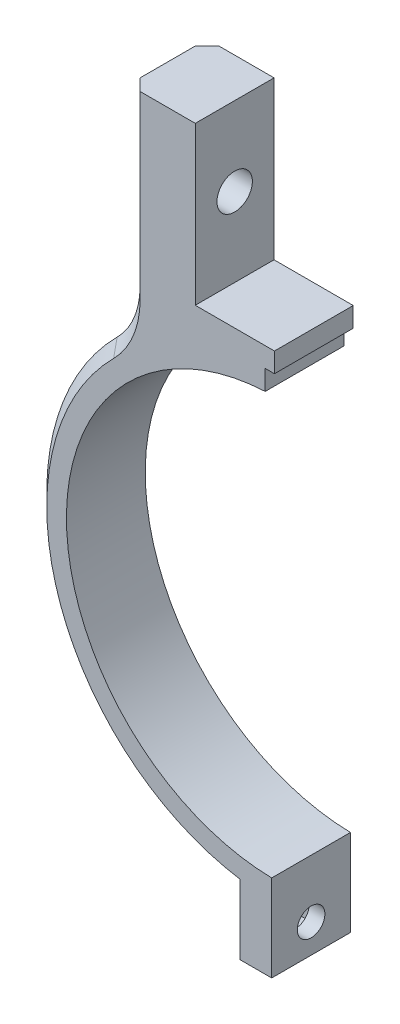
ISO-10303-21;
HEADER;
FILE_DESCRIPTION(('STEP AP214'),'2;1');
FILE_NAME('part.step','',(''),(''),'','','');
FILE_SCHEMA(('AUTOMOTIVE_DESIGN { 1 0 10303 214 1 1 1 1 }'));
ENDSEC;
DATA;
#1=APPLICATION_CONTEXT('core data for automotive mechanical design processes');
#2=APPLICATION_PROTOCOL_DEFINITION('international standard','automotive_design',2000,#1);
#3=PRODUCT_CONTEXT('',#1,'mechanical');
#4=PRODUCT('Part','Part','',(#3));
#5=PRODUCT_RELATED_PRODUCT_CATEGORY('part','',(#4));
#6=PRODUCT_DEFINITION_FORMATION('','',#4);
#7=PRODUCT_DEFINITION_CONTEXT('part definition',#1,'design');
#8=PRODUCT_DEFINITION('design','',#6,#7);
#9=PRODUCT_DEFINITION_SHAPE('','',#8);
#10=(LENGTH_UNIT() NAMED_UNIT(*) SI_UNIT(.MILLI.,.METRE.));
#11=(NAMED_UNIT(*) PLANE_ANGLE_UNIT() SI_UNIT($,.RADIAN.));
#12=(NAMED_UNIT(*) SI_UNIT($,.STERADIAN.) SOLID_ANGLE_UNIT());
#13=UNCERTAINTY_MEASURE_WITH_UNIT(LENGTH_MEASURE(1.E-05),#10,'distance_accuracy_value','');
#14=(GEOMETRIC_REPRESENTATION_CONTEXT(3) GLOBAL_UNCERTAINTY_ASSIGNED_CONTEXT((#13)) GLOBAL_UNIT_ASSIGNED_CONTEXT((#10,
#11,#12)) REPRESENTATION_CONTEXT('',''));
#15=CARTESIAN_POINT('',(0.,0.,0.));
#16=DIRECTION('',(0.,0.,1.));
#17=DIRECTION('',(1.,0.,0.));
#18=AXIS2_PLACEMENT_3D('',#15,#16,#17);
#19=CARTESIAN_POINT('',(-10.2,31.55,10.));
#20=DIRECTION('',(0.,-1.,0.));
#21=DIRECTION('',(0.,0.,-1.));
#22=AXIS2_PLACEMENT_3D('',#19,#20,#21);
#23=PLANE('',#22);
#24=DIRECTION('',(-1.,0.,0.));
#25=VECTOR('',#24,1.);
#26=CARTESIAN_POINT('',(-10.2,31.55,10.));
#27=LINE('',#26,#25);
#28=CARTESIAN_POINT('',(-0.15,31.55,10.));
#29=VERTEX_POINT('',#28);
#30=CARTESIAN_POINT('',(-10.2,31.55,10.));
#31=VERTEX_POINT('',#30);
#32=EDGE_CURVE('E263',#29,#31,#27,.T.);
#33=ORIENTED_EDGE('',*,*,#32,.F.);
#34=DIRECTION('',(0.,0.,1.));
#35=VECTOR('',#34,1.);
#36=CARTESIAN_POINT('',(-0.15,31.55,0.));
#37=LINE('',#36,#35);
#38=CARTESIAN_POINT('',(-0.15,31.55,0.));
#39=VERTEX_POINT('',#38);
#40=EDGE_CURVE('E195',#39,#29,#37,.T.);
#41=ORIENTED_EDGE('',*,*,#40,.F.);
#42=DIRECTION('',(-1.,0.,0.));
#43=VECTOR('',#42,1.);
#44=CARTESIAN_POINT('',(-10.2,31.55,0.));
#45=LINE('',#44,#43);
#46=CARTESIAN_POINT('',(-10.2,31.55,0.));
#47=VERTEX_POINT('',#46);
#48=EDGE_CURVE('E262',#39,#47,#45,.T.);
#49=ORIENTED_EDGE('',*,*,#48,.T.);
#50=DIRECTION('',(0.,0.,-1.));
#51=VECTOR('',#50,1.);
#52=CARTESIAN_POINT('',(-10.2,31.55,10.));
#53=LINE('',#52,#51);
#54=EDGE_CURVE('E312',#31,#47,#53,.T.);
#55=ORIENTED_EDGE('',*,*,#54,.F.);
#56=EDGE_LOOP('',(#33,#41,#49,#55));
#57=FACE_BOUND('',#56,.T.);
#58=ADVANCED_FACE('F38',(#57),#23,.F.);
#59=CARTESIAN_POINT('',(0.,0.,10.));
#60=DIRECTION('',(0.,0.,-1.));
#61=DIRECTION('',(-1.,0.,0.));
#62=AXIS2_PLACEMENT_3D('',#59,#60,#61);
#63=CYLINDRICAL_SURFACE('',#62,26.55);
#64=CARTESIAN_POINT('',(0.,0.,0.));
#65=DIRECTION('',(0.,0.,-1.));
#66=DIRECTION('',(1.,0.,0.));
#67=AXIS2_PLACEMENT_3D('',#64,#65,#66);
#68=CIRCLE('',#67,26.55);
#69=CARTESIAN_POINT('',(-0.50000000000001,-26.5452914845552,0.));
#70=VERTEX_POINT('',#69);
#71=CARTESIAN_POINT('',(-1.325,26.5169167702431,0.));
#72=VERTEX_POINT('',#71);
#73=EDGE_CURVE('E266',#70,#72,#68,.T.);
#74=ORIENTED_EDGE('',*,*,#73,.T.);
#75=DIRECTION('',(0.,0.,-1.));
#76=VECTOR('',#75,1.);
#77=CARTESIAN_POINT('',(-1.325,26.5169167702431,10.));
#78=LINE('',#77,#76);
#79=CARTESIAN_POINT('',(-1.325,26.5169167702431,10.));
#80=VERTEX_POINT('',#79);
#81=EDGE_CURVE('E57',#72,#80,#78,.F.);
#82=ORIENTED_EDGE('',*,*,#81,.T.);
#83=CARTESIAN_POINT('',(0.,0.,10.));
#84=DIRECTION('',(0.,0.,-1.));
#85=DIRECTION('',(1.,0.,0.));
#86=AXIS2_PLACEMENT_3D('',#83,#84,#85);
#87=CIRCLE('',#86,26.55);
#88=CARTESIAN_POINT('',(-0.50000000000001,-26.5452914845552,10.));
#89=VERTEX_POINT('',#88);
#90=EDGE_CURVE('E277',#89,#80,#87,.T.);
#91=ORIENTED_EDGE('',*,*,#90,.F.);
#92=DIRECTION('',(0.,0.,-1.));
#93=VECTOR('',#92,1.);
#94=CARTESIAN_POINT('',(-0.50000000000001,-26.5452914845552,10.));
#95=LINE('',#94,#93);
#96=EDGE_CURVE('E280',#89,#70,#95,.T.);
#97=ORIENTED_EDGE('',*,*,#96,.T.);
#98=EDGE_LOOP('',(#74,#82,#91,#97));
#99=FACE_BOUND('',#98,.T.);
#100=ADVANCED_FACE('F405',(#99),#63,.F.);
#101=CARTESIAN_POINT('',(0.,0.,10.));
#102=DIRECTION('',(0.,0.,1.));
#103=DIRECTION('',(1.,0.,0.));
#104=AXIS2_PLACEMENT_3D('',#101,#102,#103);
#105=PLANE('',#104);
#106=DIRECTION('',(0.,-1.,0.));
#107=VECTOR('',#106,1.);
#108=CARTESIAN_POINT('',(-0.15,29.05,10.));
#109=LINE('',#108,#107);
#110=CARTESIAN_POINT('',(-0.15,29.05,10.));
#111=VERTEX_POINT('',#110);
#112=EDGE_CURVE('E206',#29,#111,#109,.T.);
#113=ORIENTED_EDGE('',*,*,#112,.F.);
#114=ORIENTED_EDGE('',*,*,#32,.T.);
#115=DIRECTION('',(0.,1.,0.));
#116=VECTOR('',#115,1.);
#117=CARTESIAN_POINT('',(-10.2,31.55,10.));
#118=LINE('',#117,#116);
#119=CARTESIAN_POINT('',(-10.2,51.55,10.));
#120=VERTEX_POINT('',#119);
#121=EDGE_CURVE('E265',#31,#120,#118,.T.);
#122=ORIENTED_EDGE('',*,*,#121,.T.);
#123=DIRECTION('',(-1.,0.,0.));
#124=VECTOR('',#123,1.);
#125=CARTESIAN_POINT('',(-10.2,51.55,10.));
#126=LINE('',#125,#124);
#127=CARTESIAN_POINT('',(-17.2,51.55,10.));
#128=VERTEX_POINT('',#127);
#129=EDGE_CURVE('E268',#120,#128,#126,.T.);
#130=ORIENTED_EDGE('',*,*,#129,.T.);
#131=DIRECTION('',(0.,-1.,0.));
#132=VECTOR('',#131,1.);
#133=CARTESIAN_POINT('',(-17.2,28.6463348440948,10.));
#134=LINE('',#133,#132);
#135=CARTESIAN_POINT('',(-17.2,28.6463348440948,10.));
#136=VERTEX_POINT('',#135);
#137=EDGE_CURVE('E355',#128,#136,#134,.T.);
#138=ORIENTED_EDGE('',*,*,#137,.T.);
#139=CARTESIAN_POINT('',(-28.7,28.6463348440948,10.));
#140=DIRECTION('',(0.,0.,1.));
#141=DIRECTION('',(1.,0.,0.));
#142=AXIS2_PLACEMENT_3D('',#139,#140,#141);
#143=CIRCLE('',#142,11.5);
#144=CARTESIAN_POINT('',(-20.5606658446363,20.5222201534144,10.));
#145=VERTEX_POINT('',#144);
#146=EDGE_CURVE('E353',#136,#145,#143,.F.);
#147=ORIENTED_EDGE('',*,*,#146,.T.);
#148=CARTESIAN_POINT('',(0.,0.,10.));
#149=DIRECTION('',(0.,0.,1.));
#150=DIRECTION('',(1.,0.,0.));
#151=AXIS2_PLACEMENT_3D('',#148,#149,#150);
#152=CIRCLE('',#151,29.05);
#153=CARTESIAN_POINT('',(-4.5,-28.6993466824595,10.));
#154=VERTEX_POINT('',#153);
#155=EDGE_CURVE('E349',#145,#154,#152,.T.);
#156=ORIENTED_EDGE('',*,*,#155,.T.);
#157=DIRECTION('',(0.,-1.,0.));
#158=VECTOR('',#157,1.);
#159=CARTESIAN_POINT('',(-4.5,-37.5459080729318,10.));
#160=LINE('',#159,#158);
#161=CARTESIAN_POINT('',(-4.5,-37.5459080729318,10.));
#162=VERTEX_POINT('',#161);
#163=EDGE_CURVE('E271',#154,#162,#160,.T.);
#164=ORIENTED_EDGE('',*,*,#163,.T.);
#165=DIRECTION('',(1.,0.,0.));
#166=VECTOR('',#165,1.);
#167=CARTESIAN_POINT('',(-0.499999999999996,-37.5459080729318,10.));
#168=LINE('',#167,#166);
#169=CARTESIAN_POINT('',(-0.499999999999996,-37.5459080729318,10.));
#170=VERTEX_POINT('',#169);
#171=EDGE_CURVE('E273',#162,#170,#168,.T.);
#172=ORIENTED_EDGE('',*,*,#171,.T.);
#173=DIRECTION('',(0.,1.,0.));
#174=VECTOR('',#173,1.);
#175=CARTESIAN_POINT('',(-0.499999999999996,-30.5459080729318,10.));
#176=LINE('',#175,#174);
#177=EDGE_CURVE('E275',#170,#89,#176,.T.);
#178=ORIENTED_EDGE('',*,*,#177,.T.);
#179=ORIENTED_EDGE('',*,*,#90,.T.);
#180=DIRECTION('',(0.,-1.,0.));
#181=VECTOR('',#180,1.);
#182=CARTESIAN_POINT('',(-1.325,29.05,10.));
#183=LINE('',#182,#181);
#184=CARTESIAN_POINT('',(-1.325,29.05,10.));
#185=VERTEX_POINT('',#184);
#186=EDGE_CURVE('E209',#185,#80,#183,.T.);
#187=ORIENTED_EDGE('',*,*,#186,.F.);
#188=DIRECTION('',(-1.,0.,0.));
#189=VECTOR('',#188,1.);
#190=CARTESIAN_POINT('',(-0.15,29.05,10.));
#191=LINE('',#190,#189);
#192=EDGE_CURVE('E193',#111,#185,#191,.T.);
#193=ORIENTED_EDGE('',*,*,#192,.F.);
#194=EDGE_LOOP('',(#113,#114,#122,#130,#138,#147,#156,#164,#172,#178,#179,#187,#193));
#195=FACE_BOUND('',#194,.T.);
#196=ADVANCED_FACE('F411',(#195),#105,.T.);
#197=CARTESIAN_POINT('',(0.,0.,0.));
#198=DIRECTION('',(0.,0.,1.));
#199=DIRECTION('',(1.,0.,0.));
#200=AXIS2_PLACEMENT_3D('',#197,#198,#199);
#201=PLANE('',#200);
#202=ORIENTED_EDGE('',*,*,#48,.F.);
#203=DIRECTION('',(0.,-1.,0.));
#204=VECTOR('',#203,1.);
#205=CARTESIAN_POINT('',(-0.15,29.05,0.));
#206=LINE('',#205,#204);
#207=CARTESIAN_POINT('',(-0.15,29.05,0.));
#208=VERTEX_POINT('',#207);
#209=EDGE_CURVE('E196',#39,#208,#206,.T.);
#210=ORIENTED_EDGE('',*,*,#209,.T.);
#211=DIRECTION('',(-1.,0.,0.));
#212=VECTOR('',#211,1.);
#213=CARTESIAN_POINT('',(-0.15,29.05,0.));
#214=LINE('',#213,#212);
#215=CARTESIAN_POINT('',(-1.325,29.05,0.));
#216=VERTEX_POINT('',#215);
#217=EDGE_CURVE('E190',#208,#216,#214,.T.);
#218=ORIENTED_EDGE('',*,*,#217,.T.);
#219=DIRECTION('',(0.,-1.,0.));
#220=VECTOR('',#219,1.);
#221=CARTESIAN_POINT('',(-1.325,29.05,0.));
#222=LINE('',#221,#220);
#223=EDGE_CURVE('E198',#216,#72,#222,.T.);
#224=ORIENTED_EDGE('',*,*,#223,.T.);
#225=ORIENTED_EDGE('',*,*,#73,.F.);
#226=DIRECTION('',(0.,1.,0.));
#227=VECTOR('',#226,1.);
#228=CARTESIAN_POINT('',(-0.499999999999997,-26.5452914845552,0.));
#229=LINE('',#228,#227);
#230=CARTESIAN_POINT('',(-0.499999999999996,-37.5459080729318,0.));
#231=VERTEX_POINT('',#230);
#232=EDGE_CURVE('E292',#231,#70,#229,.T.);
#233=ORIENTED_EDGE('',*,*,#232,.F.);
#234=DIRECTION('',(1.,0.,0.));
#235=VECTOR('',#234,1.);
#236=CARTESIAN_POINT('',(-0.499999999999996,-37.5459080729318,0.));
#237=LINE('',#236,#235);
#238=CARTESIAN_POINT('',(-4.5,-37.5459080729318,0.));
#239=VERTEX_POINT('',#238);
#240=EDGE_CURVE('E289',#239,#231,#237,.T.);
#241=ORIENTED_EDGE('',*,*,#240,.F.);
#242=DIRECTION('',(0.,-1.,0.));
#243=VECTOR('',#242,1.);
#244=CARTESIAN_POINT('',(-4.5,-37.5459080729318,0.));
#245=LINE('',#244,#243);
#246=CARTESIAN_POINT('',(-4.5,-28.6993466824595,0.));
#247=VERTEX_POINT('',#246);
#248=EDGE_CURVE('E287',#247,#239,#245,.T.);
#249=ORIENTED_EDGE('',*,*,#248,.F.);
#250=CARTESIAN_POINT('',(0.,0.,0.));
#251=DIRECTION('',(0.,0.,1.));
#252=DIRECTION('',(1.,0.,0.));
#253=AXIS2_PLACEMENT_3D('',#250,#251,#252);
#254=CIRCLE('',#253,29.05);
#255=CARTESIAN_POINT('',(-20.5606658446363,20.5222201534144,0.));
#256=VERTEX_POINT('',#255);
#257=EDGE_CURVE('E328',#247,#256,#254,.F.);
#258=ORIENTED_EDGE('',*,*,#257,.T.);
#259=CARTESIAN_POINT('',(-28.7,28.6463348440948,0.));
#260=DIRECTION('',(0.,0.,1.));
#261=DIRECTION('',(1.,0.,0.));
#262=AXIS2_PLACEMENT_3D('',#259,#260,#261);
#263=CIRCLE('',#262,11.5);
#264=CARTESIAN_POINT('',(-17.2,28.6463348440948,0.));
#265=VERTEX_POINT('',#264);
#266=EDGE_CURVE('E331',#256,#265,#263,.T.);
#267=ORIENTED_EDGE('',*,*,#266,.T.);
#268=DIRECTION('',(0.,1.,0.));
#269=VECTOR('',#268,1.);
#270=CARTESIAN_POINT('',(-17.2,0.,0.));
#271=LINE('',#270,#269);
#272=CARTESIAN_POINT('',(-17.2,51.55,0.));
#273=VERTEX_POINT('',#272);
#274=EDGE_CURVE('E333',#265,#273,#271,.T.);
#275=ORIENTED_EDGE('',*,*,#274,.T.);
#276=DIRECTION('',(-1.,0.,0.));
#277=VECTOR('',#276,1.);
#278=CARTESIAN_POINT('',(-10.2,51.55,0.));
#279=LINE('',#278,#277);
#280=CARTESIAN_POINT('',(-10.2,51.55,0.));
#281=VERTEX_POINT('',#280);
#282=EDGE_CURVE('E284',#281,#273,#279,.T.);
#283=ORIENTED_EDGE('',*,*,#282,.F.);
#284=DIRECTION('',(0.,1.,0.));
#285=VECTOR('',#284,1.);
#286=CARTESIAN_POINT('',(-10.2,31.55,0.));
#287=LINE('',#286,#285);
#288=EDGE_CURVE('E282',#47,#281,#287,.T.);
#289=ORIENTED_EDGE('',*,*,#288,.F.);
#290=EDGE_LOOP('',(#202,#210,#218,#224,#225,#233,#241,#249,#258,#267,#275,#283,#289));
#291=FACE_BOUND('',#290,.T.);
#292=ADVANCED_FACE('F205',(#291),#201,.F.);
#293=CARTESIAN_POINT('',(-10.2,31.55,10.));
#294=DIRECTION('',(-1.,0.,0.));
#295=DIRECTION('',(0.,0.,1.));
#296=AXIS2_PLACEMENT_3D('',#293,#294,#295);
#297=PLANE('',#296);
#298=CARTESIAN_POINT('',(-10.2,41.55,5.));
#299=DIRECTION('',(-1.,0.,0.));
#300=DIRECTION('',(0.,0.,1.));
#301=AXIS2_PLACEMENT_3D('',#298,#299,#300);
#302=CIRCLE('',#301,2.25);
#303=CARTESIAN_POINT('',(-10.2,41.55,7.25));
#304=VERTEX_POINT('',#303);
#305=EDGE_CURVE('E256',#304,#304,#302,.T.);
#306=ORIENTED_EDGE('',*,*,#305,.T.);
#307=EDGE_LOOP('',(#306));
#308=FACE_BOUND('',#307,.T.);
#309=ORIENTED_EDGE('',*,*,#288,.T.);
#310=DIRECTION('',(0.,0.,-1.));
#311=VECTOR('',#310,1.);
#312=CARTESIAN_POINT('',(-10.2,51.55,10.));
#313=LINE('',#312,#311);
#314=EDGE_CURVE('E309',#120,#281,#313,.T.);
#315=ORIENTED_EDGE('',*,*,#314,.F.);
#316=ORIENTED_EDGE('',*,*,#121,.F.);
#317=ORIENTED_EDGE('',*,*,#54,.T.);
#318=EDGE_LOOP('',(#309,#315,#316,#317));
#319=FACE_BOUND('',#318,.T.);
#320=ADVANCED_FACE('F417',(#308,#319),#297,.F.);
#321=CARTESIAN_POINT('',(-10.2,51.55,10.));
#322=DIRECTION('',(0.,-1.,0.));
#323=DIRECTION('',(0.,0.,-1.));
#324=AXIS2_PLACEMENT_3D('',#321,#322,#323);
#325=PLANE('',#324);
#326=ORIENTED_EDGE('',*,*,#282,.T.);
#327=DIRECTION('',(0.707106781186548,0.,-0.707106781186547));
#328=VECTOR('',#327,1.);
#329=CARTESIAN_POINT('',(-18.7,51.55,1.49999999999999));
#330=LINE('',#329,#328);
#331=CARTESIAN_POINT('',(-18.7,51.55,1.49999999999999));
#332=VERTEX_POINT('',#331);
#333=EDGE_CURVE('E337',#273,#332,#330,.F.);
#334=ORIENTED_EDGE('',*,*,#333,.T.);
#335=DIRECTION('',(0.,0.,-1.));
#336=VECTOR('',#335,1.);
#337=CARTESIAN_POINT('',(-18.7,51.55,10.));
#338=LINE('',#337,#336);
#339=CARTESIAN_POINT('',(-18.7,51.55,8.5));
#340=VERTEX_POINT('',#339);
#341=EDGE_CURVE('E306',#340,#332,#338,.T.);
#342=ORIENTED_EDGE('',*,*,#341,.F.);
#343=DIRECTION('',(0.707106781186545,0.,0.70710678118655));
#344=VECTOR('',#343,1.);
#345=CARTESIAN_POINT('',(-17.2,51.55,10.));
#346=LINE('',#345,#344);
#347=EDGE_CURVE('E335',#340,#128,#346,.T.);
#348=ORIENTED_EDGE('',*,*,#347,.T.);
#349=ORIENTED_EDGE('',*,*,#129,.F.);
#350=ORIENTED_EDGE('',*,*,#314,.T.);
#351=EDGE_LOOP('',(#326,#334,#342,#348,#349,#350));
#352=FACE_BOUND('',#351,.T.);
#353=ADVANCED_FACE('F439',(#352),#325,.F.);
#354=CARTESIAN_POINT('',(-18.7,51.55,10.));
#355=DIRECTION('',(1.,0.,0.));
#356=DIRECTION('',(0.,1.,0.));
#357=AXIS2_PLACEMENT_3D('',#354,#355,#356);
#358=PLANE('',#357);
#359=CARTESIAN_POINT('',(-18.7,41.55,5.));
#360=DIRECTION('',(-1.,0.,0.));
#361=DIRECTION('',(0.,-1.,0.));
#362=AXIS2_PLACEMENT_3D('',#359,#360,#361);
#363=CIRCLE('',#362,2.25);
#364=CARTESIAN_POINT('',(-18.7,39.3,5.));
#365=VERTEX_POINT('',#364);
#366=EDGE_CURVE('E253',#365,#365,#363,.T.);
#367=ORIENTED_EDGE('',*,*,#366,.F.);
#368=EDGE_LOOP('',(#367));
#369=FACE_BOUND('',#368,.T.);
#370=ORIENTED_EDGE('',*,*,#341,.T.);
#371=DIRECTION('',(0.,-1.,0.));
#372=VECTOR('',#371,1.);
#373=CARTESIAN_POINT('',(-18.7,51.55,1.49999999999999));
#374=LINE('',#373,#372);
#375=CARTESIAN_POINT('',(-18.7,28.6463348440948,1.49999999999999));
#376=VERTEX_POINT('',#375);
#377=EDGE_CURVE('E325',#332,#376,#374,.T.);
#378=ORIENTED_EDGE('',*,*,#377,.T.);
#379=DIRECTION('',(0.,0.,1.));
#380=VECTOR('',#379,1.);
#381=CARTESIAN_POINT('',(-18.7,28.6463348440948,10.));
#382=LINE('',#381,#380);
#383=CARTESIAN_POINT('',(-18.7,28.6463348440948,8.5));
#384=VERTEX_POINT('',#383);
#385=EDGE_CURVE('E318',#376,#384,#382,.T.);
#386=ORIENTED_EDGE('',*,*,#385,.T.);
#387=DIRECTION('',(0.,1.,0.));
#388=VECTOR('',#387,1.);
#389=CARTESIAN_POINT('',(-18.7,51.55,8.5));
#390=LINE('',#389,#388);
#391=EDGE_CURVE('E321',#384,#340,#390,.T.);
#392=ORIENTED_EDGE('',*,*,#391,.T.);
#393=EDGE_LOOP('',(#370,#378,#386,#392));
#394=FACE_BOUND('',#393,.T.);
#395=ADVANCED_FACE('F443',(#369,#394),#358,.F.);
#396=CARTESIAN_POINT('',(0.,0.,10.));
#397=DIRECTION('',(0.,0.,-1.));
#398=DIRECTION('',(-1.,0.,0.));
#399=AXIS2_PLACEMENT_3D('',#396,#397,#398);
#400=CYLINDRICAL_SURFACE('',#399,30.55);
#401=DIRECTION('',(0.,0.,-1.));
#402=VECTOR('',#401,1.);
#403=CARTESIAN_POINT('',(-21.6223181257707,21.5818872869814,10.));
#404=LINE('',#403,#402);
#405=CARTESIAN_POINT('',(-21.6223181257707,21.5818872869814,8.5));
#406=VERTEX_POINT('',#405);
#407=CARTESIAN_POINT('',(-21.6223181257707,21.5818872869814,1.49999999999999));
#408=VERTEX_POINT('',#407);
#409=EDGE_CURVE('E315',#406,#408,#404,.T.);
#410=ORIENTED_EDGE('',*,*,#409,.T.);
#411=CARTESIAN_POINT('',(0.,0.,1.49999999999999));
#412=DIRECTION('',(0.,0.,1.));
#413=DIRECTION('',(1.,0.,0.));
#414=AXIS2_PLACEMENT_3D('',#411,#412,#413);
#415=CIRCLE('',#414,30.55);
#416=CARTESIAN_POINT('',(-4.5,-30.2167585951902,1.49999999999999));
#417=VERTEX_POINT('',#416);
#418=EDGE_CURVE('E346',#408,#417,#415,.T.);
#419=ORIENTED_EDGE('',*,*,#418,.T.);
#420=DIRECTION('',(0.,0.,-1.));
#421=VECTOR('',#420,1.);
#422=CARTESIAN_POINT('',(-4.5,-30.2167585951902,10.));
#423=LINE('',#422,#421);
#424=CARTESIAN_POINT('',(-4.5,-30.2167585951902,8.5));
#425=VERTEX_POINT('',#424);
#426=EDGE_CURVE('E303',#425,#417,#423,.T.);
#427=ORIENTED_EDGE('',*,*,#426,.F.);
#428=CARTESIAN_POINT('',(0.,0.,8.5));
#429=DIRECTION('',(0.,0.,1.));
#430=DIRECTION('',(1.,0.,0.));
#431=AXIS2_PLACEMENT_3D('',#428,#429,#430);
#432=CIRCLE('',#431,30.55);
#433=EDGE_CURVE('E343',#425,#406,#432,.F.);
#434=ORIENTED_EDGE('',*,*,#433,.T.);
#435=EDGE_LOOP('',(#410,#419,#427,#434));
#436=FACE_BOUND('',#435,.T.);
#437=ADVANCED_FACE('F456',(#436),#400,.T.);
#438=CARTESIAN_POINT('',(-4.5,-37.5459080729318,10.));
#439=DIRECTION('',(1.,0.,0.));
#440=DIRECTION('',(0.,1.,0.));
#441=AXIS2_PLACEMENT_3D('',#438,#439,#440);
#442=PLANE('',#441);
#443=DIRECTION('',(0.,0.,-1.));
#444=VECTOR('',#443,1.);
#445=CARTESIAN_POINT('',(-4.5,-31.106333334061,2.225));
#446=LINE('',#445,#444);
#447=CARTESIAN_POINT('',(-4.5,-31.106333334061,7.775));
#448=VERTEX_POINT('',#447);
#449=CARTESIAN_POINT('',(-4.5,-31.106333334061,2.225));
#450=VERTEX_POINT('',#449);
#451=EDGE_CURVE('E235',#448,#450,#446,.T.);
#452=ORIENTED_EDGE('',*,*,#451,.F.);
#453=DIRECTION('',(0.,1.,0.));
#454=VECTOR('',#453,1.);
#455=CARTESIAN_POINT('',(-4.5,-36.656333334061,7.775));
#456=LINE('',#455,#454);
#457=CARTESIAN_POINT('',(-4.5,-36.656333334061,7.775));
#458=VERTEX_POINT('',#457);
#459=EDGE_CURVE('E233',#458,#448,#456,.T.);
#460=ORIENTED_EDGE('',*,*,#459,.F.);
#461=DIRECTION('',(0.,0.,1.));
#462=VECTOR('',#461,1.);
#463=CARTESIAN_POINT('',(-4.5,-36.656333334061,2.225));
#464=LINE('',#463,#462);
#465=CARTESIAN_POINT('',(-4.5,-36.656333334061,2.225));
#466=VERTEX_POINT('',#465);
#467=EDGE_CURVE('E223',#466,#458,#464,.T.);
#468=ORIENTED_EDGE('',*,*,#467,.F.);
#469=DIRECTION('',(0.,-1.,0.));
#470=VECTOR('',#469,1.);
#471=CARTESIAN_POINT('',(-4.5,-36.656333334061,2.225));
#472=LINE('',#471,#470);
#473=EDGE_CURVE('E239',#450,#466,#472,.T.);
#474=ORIENTED_EDGE('',*,*,#473,.F.);
#475=EDGE_LOOP('',(#452,#460,#468,#474));
#476=FACE_BOUND('',#475,.T.);
#477=ORIENTED_EDGE('',*,*,#248,.T.);
#478=DIRECTION('',(0.,0.,-1.));
#479=VECTOR('',#478,1.);
#480=CARTESIAN_POINT('',(-4.5,-37.5459080729318,10.));
#481=LINE('',#480,#479);
#482=EDGE_CURVE('E300',#162,#239,#481,.T.);
#483=ORIENTED_EDGE('',*,*,#482,.F.);
#484=ORIENTED_EDGE('',*,*,#163,.F.);
#485=CARTESIAN_POINT('',(-4.5,-28.6993466824595,10.));
#486=CARTESIAN_POINT('',(-4.5,-28.9523221236118,9.75007430809185));
#487=CARTESIAN_POINT('',(-4.5,-29.2052608369842,9.50011146206985));
#488=CARTESIAN_POINT('',(-4.5,-29.7110648078943,9.00011146206977));
#489=CARTESIAN_POINT('',(-4.5,-29.9639300654322,8.75007430809177));
#490=CARTESIAN_POINT('',(-4.5,-30.2167585951902,8.5));
#491=B_SPLINE_CURVE_WITH_KNOTS('',3,(#485,#486,#487,#488,#489,#490),.UNSPECIFIED.,.F.,.F.,(4,2,
4),(0.,1.06683398615948,2.13366797115995),.UNSPECIFIED.);
#492=EDGE_CURVE('E11',#154,#425,#491,.T.);
#493=ORIENTED_EDGE('',*,*,#492,.T.);
#494=ORIENTED_EDGE('',*,*,#426,.T.);
#495=CARTESIAN_POINT('',(-4.5,-30.2167585951902,1.49999999999999));
#496=CARTESIAN_POINT('',(-4.5,-29.9639300654322,1.24992569190823));
#497=CARTESIAN_POINT('',(-4.5,-29.7110648078943,0.999888537930223));
#498=CARTESIAN_POINT('',(-4.5,-29.2052608369841,0.499888537930146));
#499=CARTESIAN_POINT('',(-4.5,-28.9523221236118,0.249925691908151));
#500=CARTESIAN_POINT('',(-4.5,-28.6993466824595,0.));
#501=B_SPLINE_CURVE_WITH_KNOTS('',3,(#495,#496,#497,#498,#499,#500),.UNSPECIFIED.,.F.,.F.,(4,2,
4),(0.,1.06683398500047,2.13366797115995),.UNSPECIFIED.);
#502=EDGE_CURVE('E49',#417,#247,#501,.T.);
#503=ORIENTED_EDGE('',*,*,#502,.T.);
#504=EDGE_LOOP('',(#477,#483,#484,#493,#494,#503));
#505=FACE_BOUND('',#504,.T.);
#506=ADVANCED_FACE('F370',(#476,#505),#442,.F.);
#507=CARTESIAN_POINT('',(-0.499999999999996,-37.5459080729318,10.));
#508=DIRECTION('',(0.,1.,0.));
#509=DIRECTION('',(0.,0.,1.));
#510=AXIS2_PLACEMENT_3D('',#507,#508,#509);
#511=PLANE('',#510);
#512=ORIENTED_EDGE('',*,*,#240,.T.);
#513=DIRECTION('',(0.,0.,-1.));
#514=VECTOR('',#513,1.);
#515=CARTESIAN_POINT('',(-0.499999999999996,-37.5459080729318,10.));
#516=LINE('',#515,#514);
#517=EDGE_CURVE('E297',#170,#231,#516,.T.);
#518=ORIENTED_EDGE('',*,*,#517,.F.);
#519=ORIENTED_EDGE('',*,*,#171,.F.);
#520=ORIENTED_EDGE('',*,*,#482,.T.);
#521=EDGE_LOOP('',(#512,#518,#519,#520));
#522=FACE_BOUND('',#521,.T.);
#523=ADVANCED_FACE('F475',(#522),#511,.F.);
#524=CARTESIAN_POINT('',(-0.499999999999997,-26.5452914845552,10.));
#525=DIRECTION('',(-1.,0.,0.));
#526=DIRECTION('',(0.,-1.,0.));
#527=AXIS2_PLACEMENT_3D('',#524,#525,#526);
#528=PLANE('',#527);
#529=CARTESIAN_POINT('',(-0.499999999999997,-33.881333334061,5.));
#530=DIRECTION('',(-1.,0.,0.));
#531=DIRECTION('',(0.,-1.,0.));
#532=AXIS2_PLACEMENT_3D('',#529,#530,#531);
#533=CIRCLE('',#532,1.75);
#534=CARTESIAN_POINT('',(-0.499999999999997,-35.631333334061,5.));
#535=VERTEX_POINT('',#534);
#536=EDGE_CURVE('E259',#535,#535,#533,.T.);
#537=ORIENTED_EDGE('',*,*,#536,.T.);
#538=EDGE_LOOP('',(#537));
#539=FACE_BOUND('',#538,.T.);
#540=ORIENTED_EDGE('',*,*,#232,.T.);
#541=ORIENTED_EDGE('',*,*,#96,.F.);
#542=ORIENTED_EDGE('',*,*,#177,.F.);
#543=ORIENTED_EDGE('',*,*,#517,.T.);
#544=EDGE_LOOP('',(#540,#541,#542,#543));
#545=FACE_BOUND('',#544,.T.);
#546=ADVANCED_FACE('F479',(#539,#545),#528,.F.);
#547=CARTESIAN_POINT('',(30.55,-33.881333334061,5.));
#548=DIRECTION('',(-1.,0.,0.));
#549=DIRECTION('',(0.,0.,1.));
#550=AXIS2_PLACEMENT_3D('',#547,#548,#549);
#551=CYLINDRICAL_SURFACE('',#550,1.75);
#552=CARTESIAN_POINT('',(-2.5,-33.881333334061,5.));
#553=DIRECTION('',(1.,0.,0.));
#554=DIRECTION('',(0.,1.,0.));
#555=AXIS2_PLACEMENT_3D('',#552,#553,#554);
#556=CIRCLE('',#555,1.75);
#557=CARTESIAN_POINT('',(-2.5,-32.131333334061,5.));
#558=VERTEX_POINT('',#557);
#559=EDGE_CURVE('E246',#558,#558,#556,.F.);
#560=ORIENTED_EDGE('',*,*,#559,.T.);
#561=EDGE_LOOP('',(#560));
#562=FACE_BOUND('',#561,.T.);
#563=ORIENTED_EDGE('',*,*,#536,.F.);
#564=EDGE_LOOP('',(#563));
#565=FACE_BOUND('',#564,.T.);
#566=ADVANCED_FACE('F495',(#562,#565),#551,.F.);
#567=CARTESIAN_POINT('',(30.55,41.55,5.));
#568=DIRECTION('',(-1.,0.,0.));
#569=DIRECTION('',(0.,-1.,0.));
#570=AXIS2_PLACEMENT_3D('',#567,#568,#569);
#571=CYLINDRICAL_SURFACE('',#570,2.25);
#572=ORIENTED_EDGE('',*,*,#366,.T.);
#573=EDGE_LOOP('',(#572));
#574=FACE_BOUND('',#573,.T.);
#575=ORIENTED_EDGE('',*,*,#305,.F.);
#576=EDGE_LOOP('',(#575));
#577=FACE_BOUND('',#576,.T.);
#578=ADVANCED_FACE('F422',(#574,#577),#571,.F.);
#579=CARTESIAN_POINT('',(-28.7,28.6463348440948,10.));
#580=DIRECTION('',(0.,0.,-1.));
#581=DIRECTION('',(-1.,0.,0.));
#582=AXIS2_PLACEMENT_3D('',#579,#580,#581);
#583=CYLINDRICAL_SURFACE('',#582,10.);
#584=ORIENTED_EDGE('',*,*,#385,.F.);
#585=CARTESIAN_POINT('',(-28.7,28.6463348440948,1.49999999999999));
#586=DIRECTION('',(0.,0.,1.));
#587=DIRECTION('',(1.,0.,0.));
#588=AXIS2_PLACEMENT_3D('',#585,#586,#587);
#589=CIRCLE('',#588,10.);
#590=EDGE_CURVE('E341',#376,#408,#589,.F.);
#591=ORIENTED_EDGE('',*,*,#590,.T.);
#592=ORIENTED_EDGE('',*,*,#409,.F.);
#593=CARTESIAN_POINT('',(-28.7,28.6463348440948,8.5));
#594=DIRECTION('',(0.,0.,1.));
#595=DIRECTION('',(1.,0.,0.));
#596=AXIS2_PLACEMENT_3D('',#593,#594,#595);
#597=CIRCLE('',#596,10.);
#598=EDGE_CURVE('E339',#406,#384,#597,.T.);
#599=ORIENTED_EDGE('',*,*,#598,.T.);
#600=EDGE_LOOP('',(#584,#591,#592,#599));
#601=FACE_BOUND('',#600,.T.);
#602=ADVANCED_FACE('F419',(#601),#583,.F.);
#603=CARTESIAN_POINT('',(-2.50000000000001,0.,0.));
#604=DIRECTION('',(1.,0.,0.));
#605=DIRECTION('',(0.,1.,0.));
#606=AXIS2_PLACEMENT_3D('',#603,#604,#605);
#607=PLANE('',#606);
#608=DIRECTION('',(0.,1.,0.));
#609=VECTOR('',#608,1.);
#610=CARTESIAN_POINT('',(-2.5,-36.656333334061,7.775));
#611=LINE('',#610,#609);
#612=CARTESIAN_POINT('',(-2.5,-36.656333334061,7.775));
#613=VERTEX_POINT('',#612);
#614=CARTESIAN_POINT('',(-2.5,-31.106333334061,7.775));
#615=VERTEX_POINT('',#614);
#616=EDGE_CURVE('E219',#613,#615,#611,.T.);
#617=ORIENTED_EDGE('',*,*,#616,.T.);
#618=DIRECTION('',(0.,0.,-1.));
#619=VECTOR('',#618,1.);
#620=CARTESIAN_POINT('',(-2.5,-31.106333334061,2.225));
#621=LINE('',#620,#619);
#622=CARTESIAN_POINT('',(-2.5,-31.106333334061,2.225));
#623=VERTEX_POINT('',#622);
#624=EDGE_CURVE('E222',#615,#623,#621,.T.);
#625=ORIENTED_EDGE('',*,*,#624,.T.);
#626=DIRECTION('',(0.,-1.,0.));
#627=VECTOR('',#626,1.);
#628=CARTESIAN_POINT('',(-2.5,-36.656333334061,2.225));
#629=LINE('',#628,#627);
#630=CARTESIAN_POINT('',(-2.5,-36.656333334061,2.225));
#631=VERTEX_POINT('',#630);
#632=EDGE_CURVE('E226',#623,#631,#629,.T.);
#633=ORIENTED_EDGE('',*,*,#632,.T.);
#634=DIRECTION('',(0.,0.,1.));
#635=VECTOR('',#634,1.);
#636=CARTESIAN_POINT('',(-2.5,-36.656333334061,2.225));
#637=LINE('',#636,#635);
#638=EDGE_CURVE('E229',#631,#613,#637,.T.);
#639=ORIENTED_EDGE('',*,*,#638,.T.);
#640=EDGE_LOOP('',(#617,#625,#633,#639));
#641=FACE_BOUND('',#640,.T.);
#642=ORIENTED_EDGE('',*,*,#559,.F.);
#643=EDGE_LOOP('',(#642));
#644=FACE_BOUND('',#643,.T.);
#645=ADVANCED_FACE('F421',(#641,#644),#607,.F.);
#646=CARTESIAN_POINT('',(-2.5,-36.656333334061,7.775));
#647=DIRECTION('',(0.,0.,1.));
#648=DIRECTION('',(1.,0.,0.));
#649=AXIS2_PLACEMENT_3D('',#646,#647,#648);
#650=PLANE('',#649);
#651=ORIENTED_EDGE('',*,*,#459,.T.);
#652=DIRECTION('',(-1.,0.,0.));
#653=VECTOR('',#652,1.);
#654=CARTESIAN_POINT('',(-2.5,-31.106333334061,7.775));
#655=LINE('',#654,#653);
#656=EDGE_CURVE('E232',#615,#448,#655,.T.);
#657=ORIENTED_EDGE('',*,*,#656,.F.);
#658=ORIENTED_EDGE('',*,*,#616,.F.);
#659=DIRECTION('',(-1.,0.,0.));
#660=VECTOR('',#659,1.);
#661=CARTESIAN_POINT('',(-2.5,-36.656333334061,7.775));
#662=LINE('',#661,#660);
#663=EDGE_CURVE('E244',#613,#458,#662,.T.);
#664=ORIENTED_EDGE('',*,*,#663,.T.);
#665=EDGE_LOOP('',(#651,#657,#658,#664));
#666=FACE_BOUND('',#665,.T.);
#667=ADVANCED_FACE('F504',(#666),#650,.F.);
#668=CARTESIAN_POINT('',(-2.5,-36.656333334061,2.225));
#669=DIRECTION('',(0.,-1.,0.));
#670=DIRECTION('',(1.,0.,0.));
#671=AXIS2_PLACEMENT_3D('',#668,#669,#670);
#672=PLANE('',#671);
#673=ORIENTED_EDGE('',*,*,#467,.T.);
#674=ORIENTED_EDGE('',*,*,#663,.F.);
#675=ORIENTED_EDGE('',*,*,#638,.F.);
#676=DIRECTION('',(-1.,0.,0.));
#677=VECTOR('',#676,1.);
#678=CARTESIAN_POINT('',(-2.5,-36.656333334061,2.225));
#679=LINE('',#678,#677);
#680=EDGE_CURVE('E247',#631,#466,#679,.T.);
#681=ORIENTED_EDGE('',*,*,#680,.T.);
#682=EDGE_LOOP('',(#673,#674,#675,#681));
#683=FACE_BOUND('',#682,.T.);
#684=ADVANCED_FACE('F530',(#683),#672,.F.);
#685=CARTESIAN_POINT('',(-2.5,-36.656333334061,2.225));
#686=DIRECTION('',(0.,0.,-1.));
#687=DIRECTION('',(-1.,0.,0.));
#688=AXIS2_PLACEMENT_3D('',#685,#686,#687);
#689=PLANE('',#688);
#690=ORIENTED_EDGE('',*,*,#473,.T.);
#691=ORIENTED_EDGE('',*,*,#680,.F.);
#692=ORIENTED_EDGE('',*,*,#632,.F.);
#693=DIRECTION('',(-1.,0.,0.));
#694=VECTOR('',#693,1.);
#695=CARTESIAN_POINT('',(-2.5,-31.106333334061,2.225));
#696=LINE('',#695,#694);
#697=EDGE_CURVE('E249',#623,#450,#696,.T.);
#698=ORIENTED_EDGE('',*,*,#697,.T.);
#699=EDGE_LOOP('',(#690,#691,#692,#698));
#700=FACE_BOUND('',#699,.T.);
#701=ADVANCED_FACE('F532',(#700),#689,.F.);
#702=CARTESIAN_POINT('',(-2.5,-31.106333334061,2.225));
#703=DIRECTION('',(0.,1.,0.));
#704=DIRECTION('',(-1.,0.,0.));
#705=AXIS2_PLACEMENT_3D('',#702,#703,#704);
#706=PLANE('',#705);
#707=ORIENTED_EDGE('',*,*,#451,.T.);
#708=ORIENTED_EDGE('',*,*,#697,.F.);
#709=ORIENTED_EDGE('',*,*,#624,.F.);
#710=ORIENTED_EDGE('',*,*,#656,.T.);
#711=EDGE_LOOP('',(#707,#708,#709,#710));
#712=FACE_BOUND('',#711,.T.);
#713=ADVANCED_FACE('F384',(#712),#706,.F.);
#714=CARTESIAN_POINT('',(0.,0.,1.49999999999999));
#715=DIRECTION('',(0.,0.,1.));
#716=DIRECTION('',(1.,0.,0.));
#717=AXIS2_PLACEMENT_3D('',#714,#715,#716);
#718=CONICAL_SURFACE('',#717,30.55,0.785398163397449);
#719=ORIENTED_EDGE('',*,*,#502,.F.);
#720=ORIENTED_EDGE('',*,*,#418,.F.);
#721=DIRECTION('',(-0.50046768483487,0.499531877297162,0.707106781186546));
#722=VECTOR('',#721,1.);
#723=CARTESIAN_POINT('',(-20.5606658446363,20.5222201534144,0.));
#724=LINE('',#723,#722);
#725=EDGE_CURVE('E236',#256,#408,#724,.T.);
#726=ORIENTED_EDGE('',*,*,#725,.F.);
#727=ORIENTED_EDGE('',*,*,#257,.F.);
#728=EDGE_LOOP('',(#719,#720,#726,#727));
#729=FACE_BOUND('',#728,.T.);
#730=ADVANCED_FACE('F375',(#729),#718,.T.);
#731=CARTESIAN_POINT('',(-28.7,28.6463348440948,0.));
#732=DIRECTION('',(0.,0.,-1.));
#733=DIRECTION('',(-1.,0.,0.));
#734=AXIS2_PLACEMENT_3D('',#731,#732,#733);
#735=CONICAL_SURFACE('',#734,11.5,0.785398163397449);
#736=ORIENTED_EDGE('',*,*,#725,.T.);
#737=ORIENTED_EDGE('',*,*,#590,.F.);
#738=DIRECTION('',(-0.707106781186549,0.,0.707106781186546));
#739=VECTOR('',#738,1.);
#740=CARTESIAN_POINT('',(-17.2,28.6463348440948,0.));
#741=LINE('',#740,#739);
#742=EDGE_CURVE('E446',#265,#376,#741,.T.);
#743=ORIENTED_EDGE('',*,*,#742,.F.);
#744=ORIENTED_EDGE('',*,*,#266,.F.);
#745=EDGE_LOOP('',(#736,#737,#743,#744));
#746=FACE_BOUND('',#745,.T.);
#747=ADVANCED_FACE('F383',(#746),#735,.F.);
#748=CARTESIAN_POINT('',(-18.7,51.55,1.49999999999999));
#749=DIRECTION('',(0.707106781186547,0.,0.707106781186548));
#750=DIRECTION('',(0.,-1.,0.));
#751=AXIS2_PLACEMENT_3D('',#748,#749,#750);
#752=PLANE('',#751);
#753=ORIENTED_EDGE('',*,*,#333,.F.);
#754=ORIENTED_EDGE('',*,*,#274,.F.);
#755=ORIENTED_EDGE('',*,*,#742,.T.);
#756=ORIENTED_EDGE('',*,*,#377,.F.);
#757=EDGE_LOOP('',(#753,#754,#755,#756));
#758=FACE_BOUND('',#757,.T.);
#759=ADVANCED_FACE('F401',(#758),#752,.F.);
#760=CARTESIAN_POINT('',(0.,0.,10.));
#761=DIRECTION('',(0.,0.,-1.));
#762=DIRECTION('',(-1.,0.,0.));
#763=AXIS2_PLACEMENT_3D('',#760,#761,#762);
#764=CONICAL_SURFACE('',#763,29.05,0.785398163397445);
#765=ORIENTED_EDGE('',*,*,#492,.F.);
#766=ORIENTED_EDGE('',*,*,#155,.F.);
#767=DIRECTION('',(0.500467684834867,-0.499531877297161,0.70710678118655));
#768=VECTOR('',#767,1.);
#769=CARTESIAN_POINT('',(-21.6223181257707,21.5818872869814,8.5));
#770=LINE('',#769,#768);
#771=EDGE_CURVE('E44',#406,#145,#770,.T.);
#772=ORIENTED_EDGE('',*,*,#771,.F.);
#773=ORIENTED_EDGE('',*,*,#433,.F.);
#774=EDGE_LOOP('',(#765,#766,#772,#773));
#775=FACE_BOUND('',#774,.T.);
#776=ADVANCED_FACE('F41',(#775),#764,.T.);
#777=CARTESIAN_POINT('',(-28.7,28.6463348440948,10.));
#778=DIRECTION('',(0.,0.,1.));
#779=DIRECTION('',(1.,0.,0.));
#780=AXIS2_PLACEMENT_3D('',#777,#778,#779);
#781=CONICAL_SURFACE('',#780,11.5,0.785398163397445);
#782=ORIENTED_EDGE('',*,*,#771,.T.);
#783=ORIENTED_EDGE('',*,*,#146,.F.);
#784=DIRECTION('',(0.707106781186545,0.,0.70710678118655));
#785=VECTOR('',#784,1.);
#786=CARTESIAN_POINT('',(-18.7,28.6463348440948,8.5));
#787=LINE('',#786,#785);
#788=EDGE_CURVE('E65',#384,#136,#787,.T.);
#789=ORIENTED_EDGE('',*,*,#788,.F.);
#790=ORIENTED_EDGE('',*,*,#598,.F.);
#791=EDGE_LOOP('',(#782,#783,#789,#790));
#792=FACE_BOUND('',#791,.T.);
#793=ADVANCED_FACE('F393',(#792),#781,.F.);
#794=CARTESIAN_POINT('',(-17.2,0.,10.));
#795=DIRECTION('',(-0.70710678118655,0.,0.707106781186545));
#796=DIRECTION('',(0.,1.,0.));
#797=AXIS2_PLACEMENT_3D('',#794,#795,#796);
#798=PLANE('',#797);
#799=ORIENTED_EDGE('',*,*,#347,.F.);
#800=ORIENTED_EDGE('',*,*,#391,.F.);
#801=ORIENTED_EDGE('',*,*,#788,.T.);
#802=ORIENTED_EDGE('',*,*,#137,.F.);
#803=EDGE_LOOP('',(#799,#800,#801,#802));
#804=FACE_BOUND('',#803,.T.);
#805=ADVANCED_FACE('F388',(#804),#798,.T.);
#806=CARTESIAN_POINT('',(-1.325,29.05,0.));
#807=DIRECTION('',(-1.,0.,0.));
#808=DIRECTION('',(0.,-1.,0.));
#809=AXIS2_PLACEMENT_3D('',#806,#807,#808);
#810=PLANE('',#809);
#811=ORIENTED_EDGE('',*,*,#223,.F.);
#812=DIRECTION('',(0.,0.,1.));
#813=VECTOR('',#812,1.);
#814=CARTESIAN_POINT('',(-1.325,29.05,0.));
#815=LINE('',#814,#813);
#816=EDGE_CURVE('E187',#216,#185,#815,.T.);
#817=ORIENTED_EDGE('',*,*,#816,.T.);
#818=ORIENTED_EDGE('',*,*,#186,.T.);
#819=ORIENTED_EDGE('',*,*,#81,.F.);
#820=EDGE_LOOP('',(#811,#817,#818,#819));
#821=FACE_BOUND('',#820,.T.);
#822=ADVANCED_FACE('F199',(#821),#810,.F.);
#823=CARTESIAN_POINT('',(-0.15,29.05,0.));
#824=DIRECTION('',(0.,1.,0.));
#825=DIRECTION('',(0.,0.,1.));
#826=AXIS2_PLACEMENT_3D('',#823,#824,#825);
#827=PLANE('',#826);
#828=ORIENTED_EDGE('',*,*,#192,.T.);
#829=ORIENTED_EDGE('',*,*,#816,.F.);
#830=ORIENTED_EDGE('',*,*,#217,.F.);
#831=DIRECTION('',(0.,0.,1.));
#832=VECTOR('',#831,1.);
#833=CARTESIAN_POINT('',(-0.15,29.05,0.));
#834=LINE('',#833,#832);
#835=EDGE_CURVE('E215',#208,#111,#834,.T.);
#836=ORIENTED_EDGE('',*,*,#835,.T.);
#837=EDGE_LOOP('',(#828,#829,#830,#836));
#838=FACE_BOUND('',#837,.T.);
#839=ADVANCED_FACE('F188',(#838),#827,.F.);
#840=CARTESIAN_POINT('',(-0.15,29.05,0.));
#841=DIRECTION('',(-1.,0.,0.));
#842=DIRECTION('',(0.,0.,1.));
#843=AXIS2_PLACEMENT_3D('',#840,#841,#842);
#844=PLANE('',#843);
#845=ORIENTED_EDGE('',*,*,#112,.T.);
#846=ORIENTED_EDGE('',*,*,#835,.F.);
#847=ORIENTED_EDGE('',*,*,#209,.F.);
#848=ORIENTED_EDGE('',*,*,#40,.T.);
#849=EDGE_LOOP('',(#845,#846,#847,#848));
#850=FACE_BOUND('',#849,.T.);
#851=ADVANCED_FACE('F624',(#850),#844,.F.);
#852=CLOSED_SHELL('',(#58,#100,#196,#292,#320,#353,#395,#437,#506,#523,#546,#566,#578,#602,#645,
#667,#684,#701,#713,#730,#747,#759,#776,#793,#805,#822,#839,#851));
#853=MANIFOLD_SOLID_BREP('B2',#852);
#854=ADVANCED_BREP_SHAPE_REPRESENTATION('',(#18,#853),#14);
#855=SHAPE_DEFINITION_REPRESENTATION(#9,#854);
ENDSEC;
END-ISO-10303-21;
